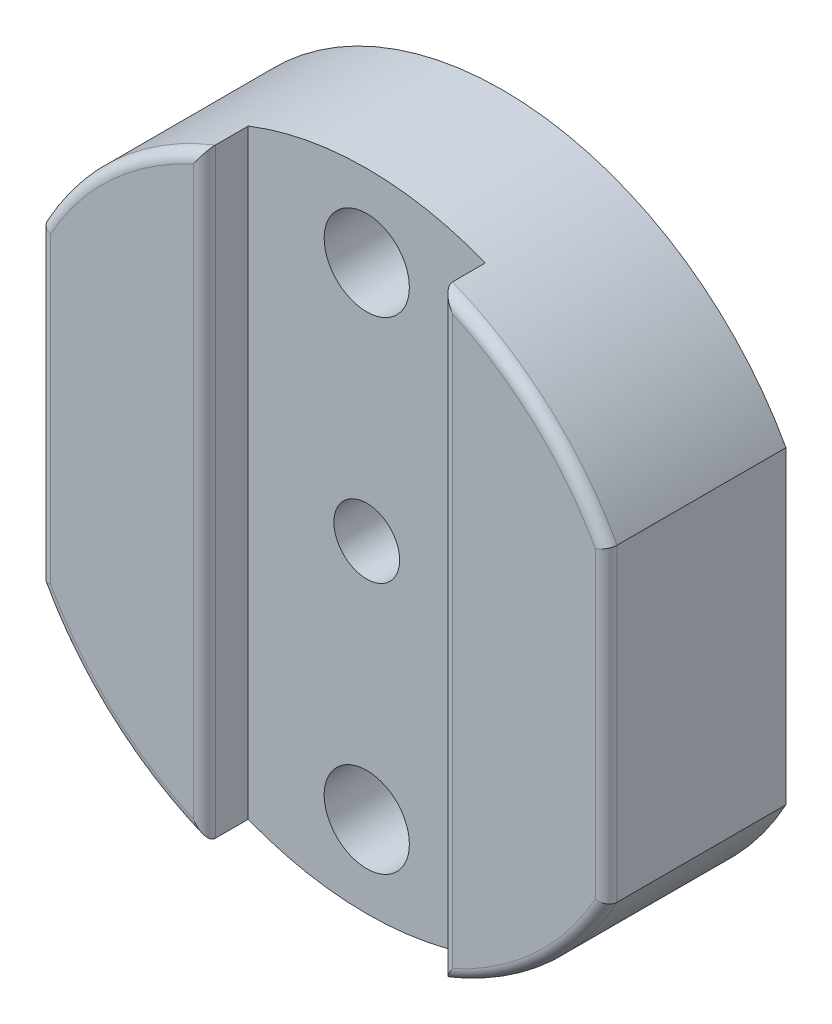
ISO-10303-21;
HEADER;
FILE_DESCRIPTION(('STEP AP214'),'2;1');
FILE_NAME('part.step','',(''),(''),'','','');
FILE_SCHEMA(('AUTOMOTIVE_DESIGN { 1 0 10303 214 1 1 1 1 }'));
ENDSEC;
DATA;
#1=APPLICATION_CONTEXT('core data for automotive mechanical design processes');
#2=APPLICATION_PROTOCOL_DEFINITION('international standard','automotive_design',2000,#1);
#3=PRODUCT_CONTEXT('',#1,'mechanical');
#4=PRODUCT('Part','Part','',(#3));
#5=PRODUCT_RELATED_PRODUCT_CATEGORY('part','',(#4));
#6=PRODUCT_DEFINITION_FORMATION('','',#4);
#7=PRODUCT_DEFINITION_CONTEXT('part definition',#1,'design');
#8=PRODUCT_DEFINITION('design','',#6,#7);
#9=PRODUCT_DEFINITION_SHAPE('','',#8);
#10=(LENGTH_UNIT() NAMED_UNIT(*) SI_UNIT(.MILLI.,.METRE.));
#11=(NAMED_UNIT(*) PLANE_ANGLE_UNIT() SI_UNIT($,.RADIAN.));
#12=(NAMED_UNIT(*) SI_UNIT($,.STERADIAN.) SOLID_ANGLE_UNIT());
#13=UNCERTAINTY_MEASURE_WITH_UNIT(LENGTH_MEASURE(1.E-05),#10,'distance_accuracy_value','');
#14=(GEOMETRIC_REPRESENTATION_CONTEXT(3) GLOBAL_UNCERTAINTY_ASSIGNED_CONTEXT((#13)) GLOBAL_UNIT_ASSIGNED_CONTEXT((#10,
#11,#12)) REPRESENTATION_CONTEXT('',''));
#15=CARTESIAN_POINT('',(0.,0.,0.));
#16=DIRECTION('',(0.,0.,1.));
#17=DIRECTION('',(1.,0.,0.));
#18=AXIS2_PLACEMENT_3D('',#15,#16,#17);
#19=CARTESIAN_POINT('',(0.,0.,0.));
#20=DIRECTION('',(0.,0.,-1.));
#21=DIRECTION('',(1.,0.,0.));
#22=AXIS2_PLACEMENT_3D('',#19,#20,#21);
#23=PLANE('',#22);
#24=CARTESIAN_POINT('',(0.,0.,0.));
#25=DIRECTION('',(0.,0.,-1.));
#26=DIRECTION('',(-1.,0.,0.));
#27=AXIS2_PLACEMENT_3D('',#24,#25,#26);
#28=CIRCLE('',#27,1.5);
#29=CARTESIAN_POINT('',(-1.5,0.,0.));
#30=VERTEX_POINT('',#29);
#31=EDGE_CURVE('E196',#30,#30,#28,.T.);
#32=ORIENTED_EDGE('',*,*,#31,.F.);
#33=EDGE_LOOP('',(#32));
#34=FACE_BOUND('',#33,.T.);
#35=CARTESIAN_POINT('',(0.,11.,0.));
#36=DIRECTION('',(0.,0.,-1.));
#37=DIRECTION('',(-1.,0.,0.));
#38=AXIS2_PLACEMENT_3D('',#35,#36,#37);
#39=CIRCLE('',#38,1.9431);
#40=CARTESIAN_POINT('',(-1.9431,11.,0.));
#41=VERTEX_POINT('',#40);
#42=EDGE_CURVE('E193',#41,#41,#39,.T.);
#43=ORIENTED_EDGE('',*,*,#42,.F.);
#44=EDGE_LOOP('',(#43));
#45=FACE_BOUND('',#44,.T.);
#46=CARTESIAN_POINT('',(0.,-11.,0.));
#47=DIRECTION('',(0.,0.,-1.));
#48=DIRECTION('',(1.,0.,0.));
#49=AXIS2_PLACEMENT_3D('',#46,#47,#48);
#50=CIRCLE('',#49,1.9431);
#51=CARTESIAN_POINT('',(1.9431,-11.,0.));
#52=VERTEX_POINT('',#51);
#53=EDGE_CURVE('E190',#52,#52,#50,.T.);
#54=ORIENTED_EDGE('',*,*,#53,.F.);
#55=EDGE_LOOP('',(#54));
#56=FACE_BOUND('',#55,.T.);
#57=DIRECTION('',(0.,1.,0.));
#58=VECTOR('',#57,1.);
#59=CARTESIAN_POINT('',(12.925,-7.0547856097829,0.));
#60=LINE('',#59,#58);
#61=CARTESIAN_POINT('',(12.925,-7.0547856097829,0.));
#62=VERTEX_POINT('',#61);
#63=CARTESIAN_POINT('',(12.925,7.05478560978291,0.));
#64=VERTEX_POINT('',#63);
#65=EDGE_CURVE('E153',#62,#64,#60,.T.);
#66=ORIENTED_EDGE('',*,*,#65,.F.);
#67=CARTESIAN_POINT('',(0.,0.,0.));
#68=DIRECTION('',(0.,0.,1.));
#69=DIRECTION('',(1.,0.,0.));
#70=AXIS2_PLACEMENT_3D('',#67,#68,#69);
#71=CIRCLE('',#70,14.725);
#72=CARTESIAN_POINT('',(-12.925,-7.0547856097829,0.));
#73=VERTEX_POINT('',#72);
#74=EDGE_CURVE('E155',#73,#62,#71,.T.);
#75=ORIENTED_EDGE('',*,*,#74,.F.);
#76=DIRECTION('',(0.,-1.,0.));
#77=VECTOR('',#76,1.);
#78=CARTESIAN_POINT('',(-12.925,7.05478560978291,0.));
#79=LINE('',#78,#77);
#80=CARTESIAN_POINT('',(-12.925,7.05478560978291,0.));
#81=VERTEX_POINT('',#80);
#82=EDGE_CURVE('E136',#81,#73,#79,.T.);
#83=ORIENTED_EDGE('',*,*,#82,.F.);
#84=CARTESIAN_POINT('',(0.,0.,0.));
#85=DIRECTION('',(0.,0.,1.));
#86=DIRECTION('',(1.,0.,0.));
#87=AXIS2_PLACEMENT_3D('',#84,#85,#86);
#88=CIRCLE('',#87,14.725);
#89=EDGE_CURVE('E147',#64,#81,#88,.T.);
#90=ORIENTED_EDGE('',*,*,#89,.F.);
#91=EDGE_LOOP('',(#66,#75,#83,#90));
#92=FACE_BOUND('',#91,.T.);
#93=ADVANCED_FACE('F33',(#34,#45,#56,#92),#23,.T.);
#94=CARTESIAN_POINT('',(0.,0.,8.2));
#95=DIRECTION('',(0.,0.,1.));
#96=DIRECTION('',(-1.,0.,0.));
#97=AXIS2_PLACEMENT_3D('',#94,#95,#96);
#98=PLANE('',#97);
#99=DIRECTION('',(0.,1.,0.));
#100=VECTOR('',#99,1.);
#101=CARTESIAN_POINT('',(-12.425,7.05478560978291,8.2));
#102=LINE('',#101,#100);
#103=CARTESIAN_POINT('',(-12.425,-6.92603782836912,8.2));
#104=VERTEX_POINT('',#103);
#105=CARTESIAN_POINT('',(-12.425,6.92603782836912,8.2));
#106=VERTEX_POINT('',#105);
#107=EDGE_CURVE('E231',#104,#106,#102,.T.);
#108=ORIENTED_EDGE('',*,*,#107,.F.);
#109=CARTESIAN_POINT('',(0.,0.,8.2));
#110=DIRECTION('',(0.,0.,-1.));
#111=DIRECTION('',(-1.,0.,0.));
#112=AXIS2_PLACEMENT_3D('',#109,#110,#111);
#113=CIRCLE('',#112,14.225);
#114=CARTESIAN_POINT('',(-5.90833333333334,-12.9399467627275,8.2));
#115=VERTEX_POINT('',#114);
#116=EDGE_CURVE('E228',#115,#104,#113,.T.);
#117=ORIENTED_EDGE('',*,*,#116,.F.);
#118=DIRECTION('',(0.,1.,0.));
#119=VECTOR('',#118,1.);
#120=CARTESIAN_POINT('',(-5.90833333333334,-13.6958225585598,8.2));
#121=LINE('',#120,#119);
#122=CARTESIAN_POINT('',(-5.90833333333334,12.9399467627275,8.2));
#123=VERTEX_POINT('',#122);
#124=EDGE_CURVE('E225',#123,#115,#121,.F.);
#125=ORIENTED_EDGE('',*,*,#124,.F.);
#126=CARTESIAN_POINT('',(0.,0.,8.2));
#127=DIRECTION('',(0.,0.,-1.));
#128=DIRECTION('',(-1.,0.,0.));
#129=AXIS2_PLACEMENT_3D('',#126,#127,#128);
#130=CIRCLE('',#129,14.225);
#131=EDGE_CURVE('E234',#106,#123,#130,.T.);
#132=ORIENTED_EDGE('',*,*,#131,.F.);
#133=EDGE_LOOP('',(#108,#117,#125,#132));
#134=FACE_BOUND('',#133,.T.);
#135=ADVANCED_FACE('F268',(#134),#98,.T.);
#136=CARTESIAN_POINT('',(0.,0.,8.2));
#137=DIRECTION('',(0.,0.,-1.));
#138=DIRECTION('',(-1.,0.,0.));
#139=AXIS2_PLACEMENT_3D('',#136,#137,#138);
#140=CIRCLE('',#139,14.225);
#141=CARTESIAN_POINT('',(5.90833333333333,12.9399467627275,8.2));
#142=VERTEX_POINT('',#141);
#143=CARTESIAN_POINT('',(12.425,6.92603782836911,8.2));
#144=VERTEX_POINT('',#143);
#145=EDGE_CURVE('E211',#142,#144,#140,.T.);
#146=ORIENTED_EDGE('',*,*,#145,.F.);
#147=DIRECTION('',(0.,-1.,0.));
#148=VECTOR('',#147,1.);
#149=CARTESIAN_POINT('',(5.90833333333333,13.6958225585598,8.2));
#150=LINE('',#149,#148);
#151=CARTESIAN_POINT('',(5.90833333333333,-12.9399467627275,8.2));
#152=VERTEX_POINT('',#151);
#153=EDGE_CURVE('E206',#152,#142,#150,.F.);
#154=ORIENTED_EDGE('',*,*,#153,.F.);
#155=CARTESIAN_POINT('',(0.,0.,8.2));
#156=DIRECTION('',(0.,0.,-1.));
#157=DIRECTION('',(-1.,0.,0.));
#158=AXIS2_PLACEMENT_3D('',#155,#156,#157);
#159=CIRCLE('',#158,14.225);
#160=CARTESIAN_POINT('',(12.425,-6.92603782836911,8.2));
#161=VERTEX_POINT('',#160);
#162=EDGE_CURVE('E209',#161,#152,#159,.T.);
#163=ORIENTED_EDGE('',*,*,#162,.F.);
#164=DIRECTION('',(0.,-1.,0.));
#165=VECTOR('',#164,1.);
#166=CARTESIAN_POINT('',(12.425,-7.0547856097829,8.2));
#167=LINE('',#166,#165);
#168=EDGE_CURVE('E214',#144,#161,#167,.T.);
#169=ORIENTED_EDGE('',*,*,#168,.F.);
#170=EDGE_LOOP('',(#146,#154,#163,#169));
#171=FACE_BOUND('',#170,.T.);
#172=ADVANCED_FACE('F272',(#171),#98,.T.);
#173=CARTESIAN_POINT('',(0.,0.,0.));
#174=DIRECTION('',(0.,0.,1.));
#175=DIRECTION('',(-1.,0.,0.));
#176=AXIS2_PLACEMENT_3D('',#173,#174,#175);
#177=CYLINDRICAL_SURFACE('',#176,1.5);
#178=CARTESIAN_POINT('',(0.,0.,6.2));
#179=DIRECTION('',(0.,0.,1.));
#180=DIRECTION('',(0.,1.,0.));
#181=AXIS2_PLACEMENT_3D('',#178,#179,#180);
#182=CIRCLE('',#181,1.5);
#183=CARTESIAN_POINT('',(0.,1.5,6.2));
#184=VERTEX_POINT('',#183);
#185=EDGE_CURVE('E183',#184,#184,#182,.T.);
#186=ORIENTED_EDGE('',*,*,#185,.T.);
#187=EDGE_LOOP('',(#186));
#188=FACE_BOUND('',#187,.T.);
#189=ORIENTED_EDGE('',*,*,#31,.T.);
#190=EDGE_LOOP('',(#189));
#191=FACE_BOUND('',#190,.T.);
#192=ADVANCED_FACE('F274',(#188,#191),#177,.F.);
#193=CARTESIAN_POINT('',(0.,11.,0.));
#194=DIRECTION('',(0.,0.,1.));
#195=DIRECTION('',(-1.,0.,0.));
#196=AXIS2_PLACEMENT_3D('',#193,#194,#195);
#197=CYLINDRICAL_SURFACE('',#196,1.9431);
#198=CARTESIAN_POINT('',(0.,11.,6.2));
#199=DIRECTION('',(0.,0.,1.));
#200=DIRECTION('',(1.,0.,0.));
#201=AXIS2_PLACEMENT_3D('',#198,#199,#200);
#202=CIRCLE('',#201,1.9431);
#203=CARTESIAN_POINT('',(1.9431,11.,6.2));
#204=VERTEX_POINT('',#203);
#205=EDGE_CURVE('E187',#204,#204,#202,.F.);
#206=ORIENTED_EDGE('',*,*,#205,.F.);
#207=EDGE_LOOP('',(#206));
#208=FACE_BOUND('',#207,.T.);
#209=ORIENTED_EDGE('',*,*,#42,.T.);
#210=EDGE_LOOP('',(#209));
#211=FACE_BOUND('',#210,.T.);
#212=ADVANCED_FACE('F277',(#208,#211),#197,.F.);
#213=CARTESIAN_POINT('',(0.,-11.,0.));
#214=DIRECTION('',(0.,0.,1.));
#215=DIRECTION('',(-1.,0.,0.));
#216=AXIS2_PLACEMENT_3D('',#213,#214,#215);
#217=CYLINDRICAL_SURFACE('',#216,1.9431);
#218=CARTESIAN_POINT('',(0.,-11.,6.2));
#219=DIRECTION('',(0.,0.,1.));
#220=DIRECTION('',(1.,0.,0.));
#221=AXIS2_PLACEMENT_3D('',#218,#219,#220);
#222=CIRCLE('',#221,1.9431);
#223=CARTESIAN_POINT('',(1.9431,-11.,6.2));
#224=VERTEX_POINT('',#223);
#225=EDGE_CURVE('E186',#224,#224,#222,.F.);
#226=ORIENTED_EDGE('',*,*,#225,.F.);
#227=EDGE_LOOP('',(#226));
#228=FACE_BOUND('',#227,.T.);
#229=ORIENTED_EDGE('',*,*,#53,.T.);
#230=EDGE_LOOP('',(#229));
#231=FACE_BOUND('',#230,.T.);
#232=ADVANCED_FACE('F281',(#228,#231),#217,.F.);
#233=CARTESIAN_POINT('',(0.,0.,6.2));
#234=DIRECTION('',(0.,0.,-1.));
#235=DIRECTION('',(0.,1.,0.));
#236=AXIS2_PLACEMENT_3D('',#233,#234,#235);
#237=PLANE('',#236);
#238=ORIENTED_EDGE('',*,*,#205,.T.);
#239=EDGE_LOOP('',(#238));
#240=FACE_BOUND('',#239,.T.);
#241=ORIENTED_EDGE('',*,*,#185,.F.);
#242=EDGE_LOOP('',(#241));
#243=FACE_BOUND('',#242,.T.);
#244=ORIENTED_EDGE('',*,*,#225,.T.);
#245=EDGE_LOOP('',(#244));
#246=FACE_BOUND('',#245,.T.);
#247=CARTESIAN_POINT('',(0.,0.,6.2));
#248=DIRECTION('',(0.,0.,1.));
#249=DIRECTION('',(1.,0.,0.));
#250=AXIS2_PLACEMENT_3D('',#247,#248,#249);
#251=CIRCLE('',#250,14.725);
#252=CARTESIAN_POINT('',(5.40833333333333,-13.6958225585598,6.2));
#253=VERTEX_POINT('',#252);
#254=CARTESIAN_POINT('',(-5.40833333333334,-13.6958225585598,6.2));
#255=VERTEX_POINT('',#254);
#256=EDGE_CURVE('E177',#253,#255,#251,.F.);
#257=ORIENTED_EDGE('',*,*,#256,.F.);
#258=DIRECTION('',(0.,-1.,0.));
#259=VECTOR('',#258,1.);
#260=CARTESIAN_POINT('',(5.40833333333333,13.7765352282256,6.2));
#261=LINE('',#260,#259);
#262=CARTESIAN_POINT('',(5.40833333333333,13.6958225585598,6.2));
#263=VERTEX_POINT('',#262);
#264=EDGE_CURVE('E162',#263,#253,#261,.T.);
#265=ORIENTED_EDGE('',*,*,#264,.F.);
#266=CARTESIAN_POINT('',(0.,0.,6.2));
#267=DIRECTION('',(0.,0.,1.));
#268=DIRECTION('',(1.,0.,0.));
#269=AXIS2_PLACEMENT_3D('',#266,#267,#268);
#270=CIRCLE('',#269,14.725);
#271=CARTESIAN_POINT('',(-5.40833333333334,13.6958225585598,6.2));
#272=VERTEX_POINT('',#271);
#273=EDGE_CURVE('E180',#272,#263,#270,.F.);
#274=ORIENTED_EDGE('',*,*,#273,.F.);
#275=DIRECTION('',(0.,1.,0.));
#276=VECTOR('',#275,1.);
#277=CARTESIAN_POINT('',(-5.40833333333334,-13.7765352282256,6.2));
#278=LINE('',#277,#276);
#279=EDGE_CURVE('E166',#255,#272,#278,.T.);
#280=ORIENTED_EDGE('',*,*,#279,.F.);
#281=EDGE_LOOP('',(#257,#265,#274,#280));
#282=FACE_BOUND('',#281,.T.);
#283=ADVANCED_FACE('F285',(#240,#243,#246,#282),#237,.F.);
#284=CARTESIAN_POINT('',(12.925,7.05478560978291,47.59746184718));
#285=DIRECTION('',(-1.,0.,0.));
#286=DIRECTION('',(0.,0.,-1.));
#287=AXIS2_PLACEMENT_3D('',#284,#285,#286);
#288=PLANE('',#287);
#289=DIRECTION('',(0.,0.,-1.));
#290=VECTOR('',#289,1.);
#291=CARTESIAN_POINT('',(12.925,-7.0547856097829,47.59746184718));
#292=LINE('',#291,#290);
#293=CARTESIAN_POINT('',(12.925,-7.0547856097829,7.7));
#294=VERTEX_POINT('',#293);
#295=EDGE_CURVE('E54',#294,#62,#292,.T.);
#296=ORIENTED_EDGE('',*,*,#295,.T.);
#297=ORIENTED_EDGE('',*,*,#65,.T.);
#298=DIRECTION('',(0.,0.,-1.));
#299=VECTOR('',#298,1.);
#300=CARTESIAN_POINT('',(12.925,7.05478560978291,47.59746184718));
#301=LINE('',#300,#299);
#302=CARTESIAN_POINT('',(12.925,7.05478560978291,7.7));
#303=VERTEX_POINT('',#302);
#304=EDGE_CURVE('E144',#303,#64,#301,.T.);
#305=ORIENTED_EDGE('',*,*,#304,.F.);
#306=DIRECTION('',(0.,-1.,0.));
#307=VECTOR('',#306,1.);
#308=CARTESIAN_POINT('',(12.925,7.05478560978291,7.7));
#309=LINE('',#308,#307);
#310=EDGE_CURVE('E217',#294,#303,#309,.F.);
#311=ORIENTED_EDGE('',*,*,#310,.F.);
#312=EDGE_LOOP('',(#296,#297,#305,#311));
#313=FACE_BOUND('',#312,.T.);
#314=ADVANCED_FACE('F289',(#313),#288,.F.);
#315=CARTESIAN_POINT('',(0.,0.,47.59746184718));
#316=DIRECTION('',(0.,0.,-1.));
#317=DIRECTION('',(1.,0.,0.));
#318=AXIS2_PLACEMENT_3D('',#315,#316,#317);
#319=CYLINDRICAL_SURFACE('',#318,14.725);
#320=ORIENTED_EDGE('',*,*,#304,.T.);
#321=ORIENTED_EDGE('',*,*,#89,.T.);
#322=DIRECTION('',(0.,0.,-1.));
#323=VECTOR('',#322,1.);
#324=CARTESIAN_POINT('',(-12.925,7.05478560978291,47.59746184718));
#325=LINE('',#324,#323);
#326=CARTESIAN_POINT('',(-12.925,7.05478560978291,7.7));
#327=VERTEX_POINT('',#326);
#328=EDGE_CURVE('E131',#327,#81,#325,.T.);
#329=ORIENTED_EDGE('',*,*,#328,.F.);
#330=CARTESIAN_POINT('',(0.,0.,7.7));
#331=DIRECTION('',(0.,0.,-1.));
#332=DIRECTION('',(-1.,0.,0.));
#333=AXIS2_PLACEMENT_3D('',#330,#331,#332);
#334=CIRCLE('',#333,14.725);
#335=CARTESIAN_POINT('',(-5.40833333333334,13.6958225585598,7.7));
#336=VERTEX_POINT('',#335);
#337=EDGE_CURVE('E220',#336,#327,#334,.F.);
#338=ORIENTED_EDGE('',*,*,#337,.F.);
#339=DIRECTION('',(0.,0.,-1.));
#340=VECTOR('',#339,1.);
#341=CARTESIAN_POINT('',(-5.40833333333334,13.6958225585598,47.59746184718));
#342=LINE('',#341,#340);
#343=EDGE_CURVE('E171',#272,#336,#342,.F.);
#344=ORIENTED_EDGE('',*,*,#343,.F.);
#345=ORIENTED_EDGE('',*,*,#273,.T.);
#346=DIRECTION('',(0.,0.,-1.));
#347=VECTOR('',#346,1.);
#348=CARTESIAN_POINT('',(5.40833333333333,13.6958225585598,47.59746184718));
#349=LINE('',#348,#347);
#350=CARTESIAN_POINT('',(5.40833333333333,13.6958225585598,7.7));
#351=VERTEX_POINT('',#350);
#352=EDGE_CURVE('E165',#351,#263,#349,.T.);
#353=ORIENTED_EDGE('',*,*,#352,.F.);
#354=CARTESIAN_POINT('',(0.,0.,7.7));
#355=DIRECTION('',(0.,0.,-1.));
#356=DIRECTION('',(-1.,0.,0.));
#357=AXIS2_PLACEMENT_3D('',#354,#355,#356);
#358=CIRCLE('',#357,14.725);
#359=EDGE_CURVE('E222',#303,#351,#358,.F.);
#360=ORIENTED_EDGE('',*,*,#359,.F.);
#361=EDGE_LOOP('',(#320,#321,#329,#338,#344,#345,#353,#360));
#362=FACE_BOUND('',#361,.T.);
#363=ADVANCED_FACE('F148',(#362),#319,.T.);
#364=CARTESIAN_POINT('',(-12.925,-7.05478560978291,47.59746184718));
#365=DIRECTION('',(1.,0.,0.));
#366=DIRECTION('',(0.,0.,1.));
#367=AXIS2_PLACEMENT_3D('',#364,#365,#366);
#368=PLANE('',#367);
#369=ORIENTED_EDGE('',*,*,#328,.T.);
#370=ORIENTED_EDGE('',*,*,#82,.T.);
#371=DIRECTION('',(0.,0.,-1.));
#372=VECTOR('',#371,1.);
#373=CARTESIAN_POINT('',(-12.925,-7.05478560978291,47.59746184718));
#374=LINE('',#373,#372);
#375=CARTESIAN_POINT('',(-12.925,-7.05478560978291,7.7));
#376=VERTEX_POINT('',#375);
#377=EDGE_CURVE('E143',#376,#73,#374,.T.);
#378=ORIENTED_EDGE('',*,*,#377,.F.);
#379=DIRECTION('',(0.,1.,0.));
#380=VECTOR('',#379,1.);
#381=CARTESIAN_POINT('',(-12.925,-7.05478560978291,7.7));
#382=LINE('',#381,#380);
#383=EDGE_CURVE('E139',#327,#376,#382,.F.);
#384=ORIENTED_EDGE('',*,*,#383,.F.);
#385=EDGE_LOOP('',(#369,#370,#378,#384));
#386=FACE_BOUND('',#385,.T.);
#387=ADVANCED_FACE('F133',(#386),#368,.F.);
#388=CARTESIAN_POINT('',(0.,0.,47.59746184718));
#389=DIRECTION('',(0.,0.,-1.));
#390=DIRECTION('',(1.,0.,0.));
#391=AXIS2_PLACEMENT_3D('',#388,#389,#390);
#392=CYLINDRICAL_SURFACE('',#391,14.725);
#393=ORIENTED_EDGE('',*,*,#377,.T.);
#394=ORIENTED_EDGE('',*,*,#74,.T.);
#395=ORIENTED_EDGE('',*,*,#295,.F.);
#396=CARTESIAN_POINT('',(0.,0.,7.7));
#397=DIRECTION('',(0.,0.,-1.));
#398=DIRECTION('',(-1.,0.,0.));
#399=AXIS2_PLACEMENT_3D('',#396,#397,#398);
#400=CIRCLE('',#399,14.725);
#401=CARTESIAN_POINT('',(5.40833333333333,-13.6958225585598,7.7));
#402=VERTEX_POINT('',#401);
#403=EDGE_CURVE('E238',#402,#294,#400,.F.);
#404=ORIENTED_EDGE('',*,*,#403,.F.);
#405=DIRECTION('',(0.,0.,-1.));
#406=VECTOR('',#405,1.);
#407=CARTESIAN_POINT('',(5.40833333333333,-13.6958225585598,47.59746184718));
#408=LINE('',#407,#406);
#409=EDGE_CURVE('E199',#253,#402,#408,.F.);
#410=ORIENTED_EDGE('',*,*,#409,.F.);
#411=ORIENTED_EDGE('',*,*,#256,.T.);
#412=DIRECTION('',(0.,0.,-1.));
#413=VECTOR('',#412,1.);
#414=CARTESIAN_POINT('',(-5.40833333333334,-13.6958225585598,47.59746184718));
#415=LINE('',#414,#413);
#416=CARTESIAN_POINT('',(-5.40833333333334,-13.6958225585598,7.7));
#417=VERTEX_POINT('',#416);
#418=EDGE_CURVE('E204',#417,#255,#415,.T.);
#419=ORIENTED_EDGE('',*,*,#418,.F.);
#420=CARTESIAN_POINT('',(0.,0.,7.7));
#421=DIRECTION('',(0.,0.,-1.));
#422=DIRECTION('',(-1.,0.,0.));
#423=AXIS2_PLACEMENT_3D('',#420,#421,#422);
#424=CIRCLE('',#423,14.725);
#425=EDGE_CURVE('E240',#376,#417,#424,.F.);
#426=ORIENTED_EDGE('',*,*,#425,.F.);
#427=EDGE_LOOP('',(#393,#394,#395,#404,#410,#411,#419,#426));
#428=FACE_BOUND('',#427,.T.);
#429=ADVANCED_FACE('F291',(#428),#392,.T.);
#430=CARTESIAN_POINT('',(5.40833333333333,13.7765352282256,-25.3042407278005));
#431=DIRECTION('',(1.,0.,0.));
#432=DIRECTION('',(0.,-1.,0.));
#433=AXIS2_PLACEMENT_3D('',#430,#431,#432);
#434=PLANE('',#433);
#435=ORIENTED_EDGE('',*,*,#352,.T.);
#436=ORIENTED_EDGE('',*,*,#264,.T.);
#437=ORIENTED_EDGE('',*,*,#409,.T.);
#438=DIRECTION('',(0.,-1.,0.));
#439=VECTOR('',#438,1.);
#440=CARTESIAN_POINT('',(5.40833333333333,-13.6958225585598,7.7));
#441=LINE('',#440,#439);
#442=EDGE_CURVE('E11',#351,#402,#441,.T.);
#443=ORIENTED_EDGE('',*,*,#442,.F.);
#444=EDGE_LOOP('',(#435,#436,#437,#443));
#445=FACE_BOUND('',#444,.T.);
#446=ADVANCED_FACE('F294',(#445),#434,.F.);
#447=CARTESIAN_POINT('',(-5.40833333333334,-13.7765352282256,-25.3042407278005));
#448=DIRECTION('',(-1.,0.,0.));
#449=DIRECTION('',(0.,0.,-1.));
#450=AXIS2_PLACEMENT_3D('',#447,#448,#449);
#451=PLANE('',#450);
#452=ORIENTED_EDGE('',*,*,#418,.T.);
#453=ORIENTED_EDGE('',*,*,#279,.T.);
#454=ORIENTED_EDGE('',*,*,#343,.T.);
#455=DIRECTION('',(0.,1.,0.));
#456=VECTOR('',#455,1.);
#457=CARTESIAN_POINT('',(-5.40833333333334,13.6958225585598,7.7));
#458=LINE('',#457,#456);
#459=EDGE_CURVE('E46',#417,#336,#458,.T.);
#460=ORIENTED_EDGE('',*,*,#459,.F.);
#461=EDGE_LOOP('',(#452,#453,#454,#460));
#462=FACE_BOUND('',#461,.T.);
#463=ADVANCED_FACE('F302',(#462),#451,.F.);
#464=CARTESIAN_POINT('',(5.90833333333333,13.7765352282256,7.7));
#465=DIRECTION('',(0.,1.,0.));
#466=DIRECTION('',(1.,0.,0.));
#467=AXIS2_PLACEMENT_3D('',#464,#465,#466);
#468=CYLINDRICAL_SURFACE('',#467,0.5);
#469=CARTESIAN_POINT('',(5.40833333333333,-13.6958225585598,7.7));
#470=CARTESIAN_POINT('',(5.40829384711575,-13.695879598566,7.719941830468));
#471=CARTESIAN_POINT('',(5.40952369239341,-13.6940727602276,7.73978940148304));
#472=CARTESIAN_POINT('',(5.4141518687906,-13.6872670984627,7.7784012695857));
#473=CARTESIAN_POINT('',(5.41752057898569,-13.6823118760416,7.79717660397759));
#474=CARTESIAN_POINT('',(5.42605070028256,-13.6697539347741,7.83322593198004));
#475=CARTESIAN_POINT('',(5.43120232346651,-13.6621656703427,7.8505074918031));
#476=CARTESIAN_POINT('',(5.44290701942942,-13.6449061619235,7.88353695736588));
#477=CARTESIAN_POINT('',(5.44946518556391,-13.6352273467318,7.89927897817633));
#478=CARTESIAN_POINT('',(5.46780994992915,-13.6081190393502,7.9379756218761));
#479=CARTESIAN_POINT('',(5.48039758049777,-13.5894870787892,7.95970205919639));
#480=CARTESIAN_POINT('',(5.50721969135807,-13.5496912465308,7.99947331858316));
#481=CARTESIAN_POINT('',(5.52145785607351,-13.5285217065654,8.01750964541701));
#482=CARTESIAN_POINT('',(5.56128397375436,-13.4691546405264,8.06189994921482));
#483=CARTESIAN_POINT('',(5.58785259761357,-13.4293922076742,8.08526320085064));
#484=CARTESIAN_POINT('',(5.64239695399889,-13.3473703668457,8.12474602810753));
#485=CARTESIAN_POINT('',(5.67037582777217,-13.3051053443137,8.14084855946047));
#486=CARTESIAN_POINT('',(5.73277862982028,-13.2103709129947,8.16967257126196));
#487=CARTESIAN_POINT('',(5.76734785958036,-13.1575859662553,8.18102398407752));
#488=CARTESIAN_POINT('',(5.83660347142049,-13.0511828706045,8.19609023690708));
#489=CARTESIAN_POINT('',(5.87128952136998,-12.9975664315286,8.1998190752563));
#490=CARTESIAN_POINT('',(5.90664314051842,-12.9425763434006,8.19999784560914));
#491=CARTESIAN_POINT('',(5.9074882921977,-12.9412615677605,8.1999999872699));
#492=CARTESIAN_POINT('',(5.90833333333333,-12.9399467627275,8.2));
#493=B_SPLINE_CURVE_WITH_KNOTS('',3,(#469,#470,#471,#472,#473,#474,#475,#476,#477,#478,#479,
#480,#481,#482,#483,#484,#485,#486,#487,#488,#489,#490,#491,#492),.UNSPECIFIED.,.F.,.F.,(4,2,2,
2,2,2,2,2,2,2,2,4),(0.,0.0595569344149257,0.118306544031722,0.176738613426598,0.235385960805568,
0.32865496727264,0.422136336140693,0.580917982757284,0.7400704472067,0.931853045733305,
1.12328313112064,1.1279720778607),.UNSPECIFIED.);
#494=EDGE_CURVE('E62',#402,#152,#493,.T.);
#495=ORIENTED_EDGE('',*,*,#494,.T.);
#496=ORIENTED_EDGE('',*,*,#153,.T.);
#497=CARTESIAN_POINT('',(5.40833333333333,13.6958225585598,7.7));
#498=CARTESIAN_POINT('',(5.40829384711576,13.695879598566,7.719941830468));
#499=CARTESIAN_POINT('',(5.40952369239341,13.6940727602276,7.73978940148304));
#500=CARTESIAN_POINT('',(5.4141518687906,13.6872670984627,7.7784012695857));
#501=CARTESIAN_POINT('',(5.41752057898569,13.6823118760416,7.79717660397759));
#502=CARTESIAN_POINT('',(5.42605070028256,13.6697539347741,7.83322593198004));
#503=CARTESIAN_POINT('',(5.43120232346651,13.6621656703427,7.8505074918031));
#504=CARTESIAN_POINT('',(5.44290701942943,13.6449061619235,7.88353695736588));
#505=CARTESIAN_POINT('',(5.44946518556391,13.6352273467318,7.89927897817633));
#506=CARTESIAN_POINT('',(5.46780994992915,13.6081190393502,7.9379756218761));
#507=CARTESIAN_POINT('',(5.48039758049777,13.5894870787892,7.95970205919639));
#508=CARTESIAN_POINT('',(5.50721969135808,13.5496912465308,7.99947331858316));
#509=CARTESIAN_POINT('',(5.52145785607351,13.5285217065654,8.01750964541701));
#510=CARTESIAN_POINT('',(5.56128397375436,13.4691546405264,8.06189994921482));
#511=CARTESIAN_POINT('',(5.58785259761357,13.4293922076742,8.08526320085064));
#512=CARTESIAN_POINT('',(5.6423969539989,13.3473703668457,8.12474602810753));
#513=CARTESIAN_POINT('',(5.67037582777217,13.3051053443137,8.14084855946047));
#514=CARTESIAN_POINT('',(5.73277862982028,13.2103709129947,8.16967257126196));
#515=CARTESIAN_POINT('',(5.76734785958036,13.1575859662553,8.18102398407752));
#516=CARTESIAN_POINT('',(5.8366034714205,13.0511828706045,8.19609023690708));
#517=CARTESIAN_POINT('',(5.87128952137001,12.9975664315286,8.1998190752563));
#518=CARTESIAN_POINT('',(5.90664314051842,12.9425763434006,8.19999784560914));
#519=CARTESIAN_POINT('',(5.9074882921977,12.9412615677605,8.1999999872699));
#520=CARTESIAN_POINT('',(5.90833333333333,12.9399467627275,8.2));
#521=B_SPLINE_CURVE_WITH_KNOTS('',3,(#497,#498,#499,#500,#501,#502,#503,#504,#505,#506,#507,
#508,#509,#510,#511,#512,#513,#514,#515,#516,#517,#518,#519,#520),.UNSPECIFIED.,.F.,.F.,(4,2,2,
2,2,2,2,2,2,2,2,4),(0.,0.0595569344149248,0.118306544031722,0.176738613426599,0.235385960805567,
0.328654967272641,0.422136336140694,0.580917982757281,0.740070447206701,0.931853045733306,
1.12328313112064,1.1279720778607),.UNSPECIFIED.);
#522=EDGE_CURVE('E169',#142,#351,#521,.F.);
#523=ORIENTED_EDGE('',*,*,#522,.T.);
#524=ORIENTED_EDGE('',*,*,#442,.T.);
#525=EDGE_LOOP('',(#495,#496,#523,#524));
#526=FACE_BOUND('',#525,.T.);
#527=ADVANCED_FACE('F305',(#526),#468,.T.);
#528=CARTESIAN_POINT('',(0.,0.,7.7));
#529=DIRECTION('',(0.,0.,1.));
#530=DIRECTION('',(-1.,0.,0.));
#531=AXIS2_PLACEMENT_3D('',#528,#529,#530);
#532=TOROIDAL_SURFACE('',#531,14.225,0.5);
#533=ORIENTED_EDGE('',*,*,#522,.F.);
#534=ORIENTED_EDGE('',*,*,#145,.T.);
#535=CARTESIAN_POINT('',(12.925,7.05478560978291,7.7));
#536=CARTESIAN_POINT('',(12.9250266323857,7.05479212371006,7.72749455468149));
#537=CARTESIAN_POINT('',(12.9227338797823,7.05420741475499,7.7549769169648));
#538=CARTESIAN_POINT('',(12.9137117403836,7.051905035872,7.80911166730306));
#539=CARTESIAN_POINT('',(12.9069893970008,7.05018916458298,7.83576530275926));
#540=CARTESIAN_POINT('',(12.8893074890651,7.04567326307848,7.88753363655224));
#541=CARTESIAN_POINT('',(12.8783471767862,7.04287304154559,7.91264806241229));
#542=CARTESIAN_POINT('',(12.8525527536699,7.03627748327187,7.96065449676721));
#543=CARTESIAN_POINT('',(12.8377185854038,7.0324821317785,7.983546472308));
#544=CARTESIAN_POINT('',(12.8044129996094,7.02395224587444,8.0268039876973));
#545=CARTESIAN_POINT('',(12.785896231308,7.01920599525172,8.04713226339118));
#546=CARTESIAN_POINT('',(12.7459022962359,7.0089424712527,8.08440773414089));
#547=CARTESIAN_POINT('',(12.7244241035228,7.00342493066499,8.10135375246148));
#548=CARTESIAN_POINT('',(12.6784478260235,6.99159839623789,8.1319128863403));
#549=CARTESIAN_POINT('',(12.6538791601634,6.98527080681206,8.14541247425757));
#550=CARTESIAN_POINT('',(12.6029485976585,6.97213439101674,8.168092411324));
#551=CARTESIAN_POINT('',(12.5765873360122,6.96532573502439,8.17727428092702));
#552=CARTESIAN_POINT('',(12.530313819227,6.95335566721117,8.18919402943552));
#553=CARTESIAN_POINT('',(12.5106532927152,6.94826441011486,8.19301489810037));
#554=CARTESIAN_POINT('',(12.4710610425511,6.93800014210565,8.1982728186992));
#555=CARTESIAN_POINT('',(12.4511298513832,6.9328272891742,8.19971401442419));
#556=CARTESIAN_POINT('',(12.4291352993358,6.92711248439711,8.19998720375143));
#557=CARTESIAN_POINT('',(12.4270675381202,6.92657515892462,8.20000003349121));
#558=CARTESIAN_POINT('',(12.425,6.92603782836911,8.2));
#559=B_SPLINE_CURVE_WITH_KNOTS('',3,(#535,#536,#537,#538,#539,#540,#541,#542,#543,#544,#545,
#546,#547,#548,#549,#550,#551,#552,#553,#554,#555,#556,#557,#558),.UNSPECIFIED.,.F.,.F.,(4,2,2,
2,2,2,2,2,2,2,2,4),(0.,0.0823636118122214,0.164596573741562,0.246844051064696,0.32909274775221,
0.412425196138169,0.495786586717777,0.581615979981275,0.667415126357681,0.729286551030306,
0.791050123201682,0.797459363185674),.UNSPECIFIED.);
#560=EDGE_CURVE('E252',#144,#303,#559,.F.);
#561=ORIENTED_EDGE('',*,*,#560,.T.);
#562=ORIENTED_EDGE('',*,*,#359,.T.);
#563=EDGE_LOOP('',(#533,#534,#561,#562));
#564=FACE_BOUND('',#563,.T.);
#565=ADVANCED_FACE('F338',(#564),#532,.T.);
#566=CARTESIAN_POINT('',(0.,0.,7.7));
#567=DIRECTION('',(0.,0.,1.));
#568=DIRECTION('',(-1.,0.,0.));
#569=AXIS2_PLACEMENT_3D('',#566,#567,#568);
#570=TOROIDAL_SURFACE('',#569,14.225,0.5);
#571=ORIENTED_EDGE('',*,*,#494,.F.);
#572=ORIENTED_EDGE('',*,*,#403,.T.);
#573=CARTESIAN_POINT('',(12.925,-7.0547856097829,7.7));
#574=CARTESIAN_POINT('',(12.9250266323857,-7.05479212371006,7.72749455468149));
#575=CARTESIAN_POINT('',(12.9227338797823,-7.054207414755,7.7549769169648));
#576=CARTESIAN_POINT('',(12.9137117403836,-7.05190503587201,7.80911166730306));
#577=CARTESIAN_POINT('',(12.9069893970008,-7.05018916458298,7.83576530275926));
#578=CARTESIAN_POINT('',(12.8893074890651,-7.04567326307848,7.88753363655224));
#579=CARTESIAN_POINT('',(12.8783471767862,-7.04287304154559,7.91264806241229));
#580=CARTESIAN_POINT('',(12.8525527536699,-7.03627748327187,7.96065449676721));
#581=CARTESIAN_POINT('',(12.8377185854038,-7.0324821317785,7.983546472308));
#582=CARTESIAN_POINT('',(12.8044129996094,-7.02395224587444,8.0268039876973));
#583=CARTESIAN_POINT('',(12.785896231308,-7.01920599525172,8.04713226339118));
#584=CARTESIAN_POINT('',(12.7459022962359,-7.0089424712527,8.08440773414089));
#585=CARTESIAN_POINT('',(12.7244241035228,-7.003424930665,8.10135375246148));
#586=CARTESIAN_POINT('',(12.6784478260235,-6.99159839623789,8.1319128863403));
#587=CARTESIAN_POINT('',(12.6538791601634,-6.98527080681206,8.14541247425757));
#588=CARTESIAN_POINT('',(12.6029485976585,-6.97213439101674,8.168092411324));
#589=CARTESIAN_POINT('',(12.5765873360122,-6.96532573502439,8.17727428092702));
#590=CARTESIAN_POINT('',(12.530313819227,-6.95335566721117,8.18919402943552));
#591=CARTESIAN_POINT('',(12.5106532927152,-6.94826441011485,8.19301489810037));
#592=CARTESIAN_POINT('',(12.4710610425511,-6.93800014210566,8.1982728186992));
#593=CARTESIAN_POINT('',(12.4511298513832,-6.93282728917425,8.19971401442419));
#594=CARTESIAN_POINT('',(12.4291352993358,-6.92711248439711,8.19998720375143));
#595=CARTESIAN_POINT('',(12.4270675381202,-6.92657515892463,8.20000003349121));
#596=CARTESIAN_POINT('',(12.425,-6.92603782836911,8.2));
#597=B_SPLINE_CURVE_WITH_KNOTS('',3,(#573,#574,#575,#576,#577,#578,#579,#580,#581,#582,#583,
#584,#585,#586,#587,#588,#589,#590,#591,#592,#593,#594,#595,#596),.UNSPECIFIED.,.F.,.F.,(4,2,2,
2,2,2,2,2,2,2,2,4),(0.,0.0823636118122213,0.164596573741562,0.246844051064696,0.32909274775221,
0.412425196138169,0.495786586717777,0.581615979981275,0.667415126357681,0.729286551030308,
0.791050123201684,0.797459363185674),.UNSPECIFIED.);
#598=EDGE_CURVE('E245',#294,#161,#597,.T.);
#599=ORIENTED_EDGE('',*,*,#598,.T.);
#600=ORIENTED_EDGE('',*,*,#162,.T.);
#601=EDGE_LOOP('',(#571,#572,#599,#600));
#602=FACE_BOUND('',#601,.T.);
#603=ADVANCED_FACE('F258',(#602),#570,.T.);
#604=CARTESIAN_POINT('',(12.425,0.,7.7));
#605=DIRECTION('',(0.,1.,0.));
#606=DIRECTION('',(0.,0.,1.));
#607=AXIS2_PLACEMENT_3D('',#604,#605,#606);
#608=CYLINDRICAL_SURFACE('',#607,0.5);
#609=ORIENTED_EDGE('',*,*,#560,.F.);
#610=ORIENTED_EDGE('',*,*,#168,.T.);
#611=ORIENTED_EDGE('',*,*,#598,.F.);
#612=ORIENTED_EDGE('',*,*,#310,.T.);
#613=EDGE_LOOP('',(#609,#610,#611,#612));
#614=FACE_BOUND('',#613,.T.);
#615=ADVANCED_FACE('F260',(#614),#608,.T.);
#616=CARTESIAN_POINT('',(0.,0.,7.7));
#617=DIRECTION('',(0.,0.,1.));
#618=DIRECTION('',(-1.,0.,0.));
#619=AXIS2_PLACEMENT_3D('',#616,#617,#618);
#620=TOROIDAL_SURFACE('',#619,14.225,0.5);
#621=CARTESIAN_POINT('',(-5.40833333333334,-13.6958225585598,7.7));
#622=CARTESIAN_POINT('',(-5.40829384711576,-13.695879598566,7.719941830468));
#623=CARTESIAN_POINT('',(-5.40952369239342,-13.6940727602276,7.73978940148304));
#624=CARTESIAN_POINT('',(-5.41415186879061,-13.6872670984627,7.7784012695857));
#625=CARTESIAN_POINT('',(-5.41752057898569,-13.6823118760416,7.79717660397759));
#626=CARTESIAN_POINT('',(-5.42605070028257,-13.6697539347741,7.83322593198004));
#627=CARTESIAN_POINT('',(-5.43120232346651,-13.6621656703427,7.8505074918031));
#628=CARTESIAN_POINT('',(-5.44290701942943,-13.6449061619235,7.88353695736588));
#629=CARTESIAN_POINT('',(-5.44946518556391,-13.6352273467318,7.89927897817633));
#630=CARTESIAN_POINT('',(-5.46780994992916,-13.6081190393502,7.9379756218761));
#631=CARTESIAN_POINT('',(-5.48039758049777,-13.5894870787892,7.95970205919639));
#632=CARTESIAN_POINT('',(-5.50721969135808,-13.5496912465308,7.99947331858316));
#633=CARTESIAN_POINT('',(-5.52145785607352,-13.5285217065654,8.01750964541702));
#634=CARTESIAN_POINT('',(-5.56128397375437,-13.4691546405264,8.06189994921482));
#635=CARTESIAN_POINT('',(-5.58785259761358,-13.4293922076742,8.08526320085065));
#636=CARTESIAN_POINT('',(-5.64239695399891,-13.3473703668457,8.12474602810753));
#637=CARTESIAN_POINT('',(-5.67037582777218,-13.3051053443137,8.14084855946047));
#638=CARTESIAN_POINT('',(-5.73277862982029,-13.2103709129947,8.16967257126196));
#639=CARTESIAN_POINT('',(-5.76734785958037,-13.1575859662553,8.18102398407752));
#640=CARTESIAN_POINT('',(-5.83660347142051,-13.0511828706045,8.19609023690708));
#641=CARTESIAN_POINT('',(-5.87128952137001,-12.9975664315286,8.1998190752563));
#642=CARTESIAN_POINT('',(-5.90664314051843,-12.9425763434006,8.19999784560914));
#643=CARTESIAN_POINT('',(-5.90748829219771,-12.9412615677605,8.1999999872699));
#644=CARTESIAN_POINT('',(-5.90833333333334,-12.9399467627275,8.2));
#645=B_SPLINE_CURVE_WITH_KNOTS('',3,(#621,#622,#623,#624,#625,#626,#627,#628,#629,#630,#631,
#632,#633,#634,#635,#636,#637,#638,#639,#640,#641,#642,#643,#644),.UNSPECIFIED.,.F.,.F.,(4,2,2,
2,2,2,2,2,2,2,2,4),(0.,0.0595569344149239,0.118306544031723,0.176738613426598,0.235385960805569,
0.328654967272645,0.422136336140699,0.580917982757292,0.740070447206714,0.931853045733312,
1.12328313112064,1.1279720778607),.UNSPECIFIED.);
#646=EDGE_CURVE('E356',#417,#115,#645,.T.);
#647=ORIENTED_EDGE('',*,*,#646,.T.);
#648=ORIENTED_EDGE('',*,*,#116,.T.);
#649=CARTESIAN_POINT('',(-12.925,-7.05478560978291,7.7));
#650=CARTESIAN_POINT('',(-12.9250266323857,-7.05479212371007,7.72749455468149));
#651=CARTESIAN_POINT('',(-12.9227338797823,-7.05420741475501,7.7549769169648));
#652=CARTESIAN_POINT('',(-12.9137117403835,-7.05190503587202,7.80911166730306));
#653=CARTESIAN_POINT('',(-12.9069893970008,-7.05018916458299,7.83576530275926));
#654=CARTESIAN_POINT('',(-12.8893074890651,-7.04567326307849,7.88753363655224));
#655=CARTESIAN_POINT('',(-12.8783471767862,-7.0428730415456,7.91264806241229));
#656=CARTESIAN_POINT('',(-12.8525527536699,-7.03627748327188,7.96065449676721));
#657=CARTESIAN_POINT('',(-12.8377185854038,-7.03248213177851,7.983546472308));
#658=CARTESIAN_POINT('',(-12.8044129996094,-7.02395224587445,8.0268039876973));
#659=CARTESIAN_POINT('',(-12.7858962313079,-7.01920599525173,8.04713226339118));
#660=CARTESIAN_POINT('',(-12.7459022962359,-7.0089424712527,8.08440773414089));
#661=CARTESIAN_POINT('',(-12.7244241035228,-7.003424930665,8.10135375246148));
#662=CARTESIAN_POINT('',(-12.6784478260235,-6.99159839623789,8.1319128863403));
#663=CARTESIAN_POINT('',(-12.6538791601634,-6.98527080681207,8.14541247425757));
#664=CARTESIAN_POINT('',(-12.6029485976585,-6.97213439101675,8.168092411324));
#665=CARTESIAN_POINT('',(-12.5765873360122,-6.96532573502439,8.17727428092702));
#666=CARTESIAN_POINT('',(-12.530313819227,-6.95335566721118,8.18919402943552));
#667=CARTESIAN_POINT('',(-12.5106532927152,-6.94826441011487,8.19301489810037));
#668=CARTESIAN_POINT('',(-12.4710610425511,-6.93800014210566,8.1982728186992));
#669=CARTESIAN_POINT('',(-12.4511298513832,-6.93282728917421,8.19971401442419));
#670=CARTESIAN_POINT('',(-12.4291352993358,-6.92711248439711,8.19998720375143));
#671=CARTESIAN_POINT('',(-12.4270675381202,-6.92657515892463,8.20000003349121));
#672=CARTESIAN_POINT('',(-12.425,-6.92603782836912,8.2));
#673=B_SPLINE_CURVE_WITH_KNOTS('',3,(#649,#650,#651,#652,#653,#654,#655,#656,#657,#658,#659,
#660,#661,#662,#663,#664,#665,#666,#667,#668,#669,#670,#671,#672),.UNSPECIFIED.,.F.,.F.,(4,2,2,
2,2,2,2,2,2,2,2,4),(0.,0.0823636118122213,0.164596573741562,0.246844051064696,0.329092747752209,
0.412425196138169,0.495786586717778,0.581615979981276,0.667415126357682,0.729286551030307,
0.791050123201682,0.797459363185674),.UNSPECIFIED.);
#674=EDGE_CURVE('E38',#104,#376,#673,.F.);
#675=ORIENTED_EDGE('',*,*,#674,.T.);
#676=ORIENTED_EDGE('',*,*,#425,.T.);
#677=EDGE_LOOP('',(#647,#648,#675,#676));
#678=FACE_BOUND('',#677,.T.);
#679=ADVANCED_FACE('F35',(#678),#620,.T.);
#680=CARTESIAN_POINT('',(-12.425,0.,7.7));
#681=DIRECTION('',(0.,-1.,0.));
#682=DIRECTION('',(0.,0.,-1.));
#683=AXIS2_PLACEMENT_3D('',#680,#681,#682);
#684=CYLINDRICAL_SURFACE('',#683,0.5);
#685=ORIENTED_EDGE('',*,*,#674,.F.);
#686=ORIENTED_EDGE('',*,*,#107,.T.);
#687=CARTESIAN_POINT('',(-12.925,7.05478560978291,7.7));
#688=CARTESIAN_POINT('',(-12.9250266323857,7.05479212371007,7.72749455468149));
#689=CARTESIAN_POINT('',(-12.9227338797823,7.05420741475501,7.7549769169648));
#690=CARTESIAN_POINT('',(-12.9137117403835,7.05190503587201,7.80911166730306));
#691=CARTESIAN_POINT('',(-12.9069893970008,7.05018916458298,7.83576530275926));
#692=CARTESIAN_POINT('',(-12.8893074890651,7.04567326307848,7.88753363655224));
#693=CARTESIAN_POINT('',(-12.8783471767862,7.0428730415456,7.91264806241229));
#694=CARTESIAN_POINT('',(-12.8525527536699,7.03627748327188,7.96065449676721));
#695=CARTESIAN_POINT('',(-12.8377185854038,7.03248213177851,7.983546472308));
#696=CARTESIAN_POINT('',(-12.8044129996094,7.02395224587445,8.0268039876973));
#697=CARTESIAN_POINT('',(-12.7858962313079,7.01920599525173,8.04713226339118));
#698=CARTESIAN_POINT('',(-12.7459022962359,7.0089424712527,8.08440773414089));
#699=CARTESIAN_POINT('',(-12.7244241035228,7.003424930665,8.10135375246148));
#700=CARTESIAN_POINT('',(-12.6784478260235,6.99159839623789,8.1319128863403));
#701=CARTESIAN_POINT('',(-12.6538791601634,6.98527080681207,8.14541247425757));
#702=CARTESIAN_POINT('',(-12.6029485976585,6.97213439101675,8.168092411324));
#703=CARTESIAN_POINT('',(-12.5765873360122,6.96532573502439,8.17727428092702));
#704=CARTESIAN_POINT('',(-12.530313819227,6.95335566721118,8.18919402943552));
#705=CARTESIAN_POINT('',(-12.5106532927152,6.94826441011487,8.19301489810037));
#706=CARTESIAN_POINT('',(-12.4710610425511,6.93800014210566,8.1982728186992));
#707=CARTESIAN_POINT('',(-12.4511298513832,6.93282728917421,8.19971401442419));
#708=CARTESIAN_POINT('',(-12.4291352993358,6.92711248439711,8.19998720375143));
#709=CARTESIAN_POINT('',(-12.4270675381202,6.92657515892463,8.20000003349121));
#710=CARTESIAN_POINT('',(-12.425,6.92603782836912,8.2));
#711=B_SPLINE_CURVE_WITH_KNOTS('',3,(#687,#688,#689,#690,#691,#692,#693,#694,#695,#696,#697,
#698,#699,#700,#701,#702,#703,#704,#705,#706,#707,#708,#709,#710),.UNSPECIFIED.,.F.,.F.,(4,2,2,
2,2,2,2,2,2,2,2,4),(0.,0.0823636118122206,0.164596573741562,0.246844051064696,0.329092747752209,
0.412425196138169,0.495786586717778,0.581615979981276,0.667415126357682,0.729286551030307,
0.791050123201682,0.797459363185674),.UNSPECIFIED.);
#712=EDGE_CURVE('E158',#106,#327,#711,.F.);
#713=ORIENTED_EDGE('',*,*,#712,.T.);
#714=ORIENTED_EDGE('',*,*,#383,.T.);
#715=EDGE_LOOP('',(#685,#686,#713,#714));
#716=FACE_BOUND('',#715,.T.);
#717=ADVANCED_FACE('F360',(#716),#684,.T.);
#718=CARTESIAN_POINT('',(-5.90833333333334,-13.7765352282256,7.7));
#719=DIRECTION('',(0.,-1.,0.));
#720=DIRECTION('',(0.,0.,-1.));
#721=AXIS2_PLACEMENT_3D('',#718,#719,#720);
#722=CYLINDRICAL_SURFACE('',#721,0.5);
#723=ORIENTED_EDGE('',*,*,#646,.F.);
#724=ORIENTED_EDGE('',*,*,#459,.T.);
#725=CARTESIAN_POINT('',(-5.40833333333334,13.6958225585598,7.7));
#726=CARTESIAN_POINT('',(-5.40829384711576,13.695879598566,7.719941830468));
#727=CARTESIAN_POINT('',(-5.40952369239342,13.6940727602276,7.73978940148304));
#728=CARTESIAN_POINT('',(-5.41415186879061,13.6872670984627,7.7784012695857));
#729=CARTESIAN_POINT('',(-5.41752057898569,13.6823118760416,7.79717660397759));
#730=CARTESIAN_POINT('',(-5.42605070028257,13.6697539347741,7.83322593198004));
#731=CARTESIAN_POINT('',(-5.43120232346651,13.6621656703427,7.8505074918031));
#732=CARTESIAN_POINT('',(-5.44290701942943,13.6449061619235,7.88353695736588));
#733=CARTESIAN_POINT('',(-5.44946518556391,13.6352273467318,7.89927897817633));
#734=CARTESIAN_POINT('',(-5.46780994992916,13.6081190393502,7.9379756218761));
#735=CARTESIAN_POINT('',(-5.48039758049777,13.5894870787892,7.95970205919639));
#736=CARTESIAN_POINT('',(-5.50721969135808,13.5496912465308,7.99947331858316));
#737=CARTESIAN_POINT('',(-5.52145785607352,13.5285217065654,8.01750964541702));
#738=CARTESIAN_POINT('',(-5.56128397375437,13.4691546405264,8.06189994921482));
#739=CARTESIAN_POINT('',(-5.58785259761358,13.4293922076742,8.08526320085065));
#740=CARTESIAN_POINT('',(-5.64239695399891,13.3473703668457,8.12474602810753));
#741=CARTESIAN_POINT('',(-5.67037582777218,13.3051053443137,8.14084855946047));
#742=CARTESIAN_POINT('',(-5.73277862982029,13.2103709129947,8.16967257126196));
#743=CARTESIAN_POINT('',(-5.76734785958037,13.1575859662553,8.18102398407752));
#744=CARTESIAN_POINT('',(-5.83660347142051,13.0511828706045,8.19609023690708));
#745=CARTESIAN_POINT('',(-5.87128952137001,12.9975664315286,8.1998190752563));
#746=CARTESIAN_POINT('',(-5.90664314051843,12.9425763434006,8.19999784560914));
#747=CARTESIAN_POINT('',(-5.90748829219771,12.9412615677605,8.1999999872699));
#748=CARTESIAN_POINT('',(-5.90833333333334,12.9399467627275,8.2));
#749=B_SPLINE_CURVE_WITH_KNOTS('',3,(#725,#726,#727,#728,#729,#730,#731,#732,#733,#734,#735,
#736,#737,#738,#739,#740,#741,#742,#743,#744,#745,#746,#747,#748),.UNSPECIFIED.,.F.,.F.,(4,2,2,
2,2,2,2,2,2,2,2,4),(0.,0.0595569344149239,0.118306544031723,0.176738613426598,0.235385960805569,
0.328654967272645,0.422136336140699,0.580917982757292,0.740070447206714,0.931853045733312,
1.12328313112064,1.1279720778607),.UNSPECIFIED.);
#750=EDGE_CURVE('E156',#336,#123,#749,.T.);
#751=ORIENTED_EDGE('',*,*,#750,.T.);
#752=ORIENTED_EDGE('',*,*,#124,.T.);
#753=EDGE_LOOP('',(#723,#724,#751,#752));
#754=FACE_BOUND('',#753,.T.);
#755=ADVANCED_FACE('F345',(#754),#722,.T.);
#756=CARTESIAN_POINT('',(0.,0.,7.7));
#757=DIRECTION('',(0.,0.,1.));
#758=DIRECTION('',(-1.,0.,0.));
#759=AXIS2_PLACEMENT_3D('',#756,#757,#758);
#760=TOROIDAL_SURFACE('',#759,14.225,0.5);
#761=ORIENTED_EDGE('',*,*,#712,.F.);
#762=ORIENTED_EDGE('',*,*,#131,.T.);
#763=ORIENTED_EDGE('',*,*,#750,.F.);
#764=ORIENTED_EDGE('',*,*,#337,.T.);
#765=EDGE_LOOP('',(#761,#762,#763,#764));
#766=FACE_BOUND('',#765,.T.);
#767=ADVANCED_FACE('F340',(#766),#760,.T.);
#768=CLOSED_SHELL('',(#93,#135,#172,#192,#212,#232,#283,#314,#363,#387,#429,#446,#463,#527,#565,
#603,#615,#679,#717,#755,#767));
#769=MANIFOLD_SOLID_BREP('B2',#768);
#770=ADVANCED_BREP_SHAPE_REPRESENTATION('',(#18,#769),#14);
#771=SHAPE_DEFINITION_REPRESENTATION(#9,#770);
ENDSEC;
END-ISO-10303-21;
